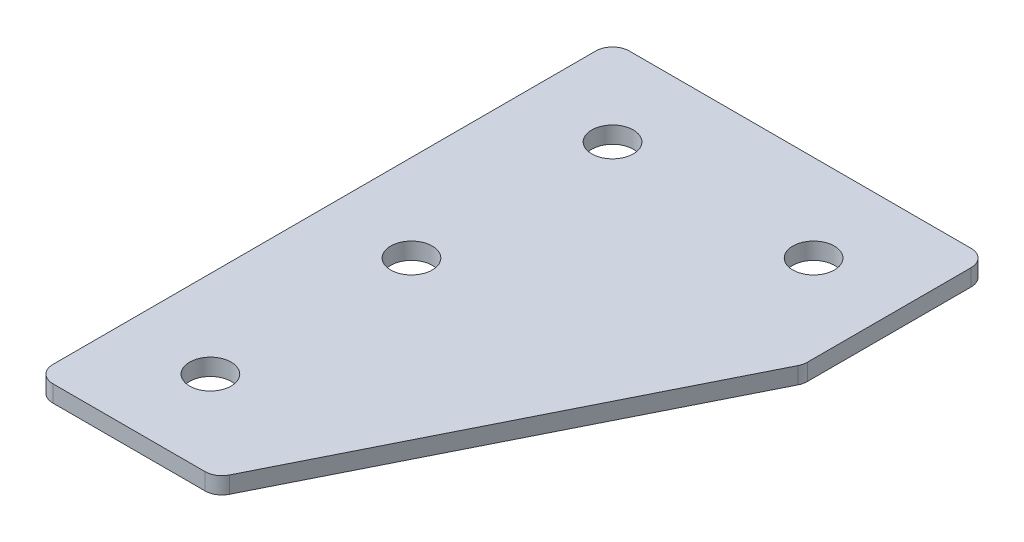
ISO-10303-21;
HEADER;
FILE_DESCRIPTION(('STEP AP214'),'2;1');
FILE_NAME('part.step','',(''),(''),'','','');
FILE_SCHEMA(('AUTOMOTIVE_DESIGN { 1 0 10303 214 1 1 1 1 }'));
ENDSEC;
DATA;
#1=APPLICATION_CONTEXT('core data for automotive mechanical design processes');
#2=APPLICATION_PROTOCOL_DEFINITION('international standard','automotive_design',2000,#1);
#3=PRODUCT_CONTEXT('',#1,'mechanical');
#4=PRODUCT('Part','Part','',(#3));
#5=PRODUCT_RELATED_PRODUCT_CATEGORY('part','',(#4));
#6=PRODUCT_DEFINITION_FORMATION('','',#4);
#7=PRODUCT_DEFINITION_CONTEXT('part definition',#1,'design');
#8=PRODUCT_DEFINITION('design','',#6,#7);
#9=PRODUCT_DEFINITION_SHAPE('','',#8);
#10=(LENGTH_UNIT() NAMED_UNIT(*) SI_UNIT(.MILLI.,.METRE.));
#11=(NAMED_UNIT(*) PLANE_ANGLE_UNIT() SI_UNIT($,.RADIAN.));
#12=(NAMED_UNIT(*) SI_UNIT($,.STERADIAN.) SOLID_ANGLE_UNIT());
#13=UNCERTAINTY_MEASURE_WITH_UNIT(LENGTH_MEASURE(1.E-05),#10,'distance_accuracy_value','');
#14=(GEOMETRIC_REPRESENTATION_CONTEXT(3) GLOBAL_UNCERTAINTY_ASSIGNED_CONTEXT((#13)) GLOBAL_UNIT_ASSIGNED_CONTEXT((#10,
#11,#12)) REPRESENTATION_CONTEXT('',''));
#15=CARTESIAN_POINT('',(0.,0.,0.));
#16=DIRECTION('',(0.,0.,1.));
#17=DIRECTION('',(1.,0.,0.));
#18=AXIS2_PLACEMENT_3D('',#15,#16,#17);
#19=CARTESIAN_POINT('',(-15.9120032783015,0.374792376219375,-30.7125250450599));
#20=DIRECTION('',(0.,-1.,0.));
#21=DIRECTION('',(0.,0.,-1.));
#22=AXIS2_PLACEMENT_3D('',#19,#20,#21);
#23=PLANE('',#22);
#24=CARTESIAN_POINT('',(-15.9120032783016,0.374792376219375,29.2874749549401));
#25=DIRECTION('',(0.,1.,0.));
#26=DIRECTION('',(0.,0.,1.));
#27=AXIS2_PLACEMENT_3D('',#24,#25,#26);
#28=CIRCLE('',#27,3.1);
#29=CARTESIAN_POINT('',(-15.9120032783016,0.374792376219375,32.3874749549401));
#30=VERTEX_POINT('',#29);
#31=EDGE_CURVE('E245',#30,#30,#28,.T.);
#32=ORIENTED_EDGE('',*,*,#31,.T.);
#33=EDGE_LOOP('',(#32));
#34=FACE_BOUND('',#33,.T.);
#35=CARTESIAN_POINT('',(-15.9120032783016,0.374792376219375,-0.712525045059878));
#36=DIRECTION('',(0.,1.,0.));
#37=DIRECTION('',(0.,0.,1.));
#38=AXIS2_PLACEMENT_3D('',#35,#36,#37);
#39=CIRCLE('',#38,3.1);
#40=CARTESIAN_POINT('',(-15.9120032783016,0.374792376219375,2.38747495494012));
#41=VERTEX_POINT('',#40);
#42=EDGE_CURVE('E253',#41,#41,#39,.T.);
#43=ORIENTED_EDGE('',*,*,#42,.T.);
#44=EDGE_LOOP('',(#43));
#45=FACE_BOUND('',#44,.T.);
#46=CARTESIAN_POINT('',(14.0879967216985,0.374792376219375,-30.7125250450599));
#47=DIRECTION('',(0.,1.,0.));
#48=DIRECTION('',(0.,0.,1.));
#49=AXIS2_PLACEMENT_3D('',#46,#47,#48);
#50=CIRCLE('',#49,3.1);
#51=CARTESIAN_POINT('',(14.0879967216985,0.374792376219375,-27.6125250450599));
#52=VERTEX_POINT('',#51);
#53=EDGE_CURVE('E259',#52,#52,#50,.T.);
#54=ORIENTED_EDGE('',*,*,#53,.T.);
#55=EDGE_LOOP('',(#54));
#56=FACE_BOUND('',#55,.T.);
#57=CARTESIAN_POINT('',(-15.9120032783015,0.374792376219375,-30.7125250450599));
#58=DIRECTION('',(0.,1.,0.));
#59=DIRECTION('',(0.,0.,1.));
#60=AXIS2_PLACEMENT_3D('',#57,#58,#59);
#61=CIRCLE('',#60,3.1);
#62=CARTESIAN_POINT('',(-15.9120032783015,0.374792376219375,-27.6125250450599));
#63=VERTEX_POINT('',#62);
#64=EDGE_CURVE('E176',#63,#63,#61,.T.);
#65=ORIENTED_EDGE('',*,*,#64,.T.);
#66=EDGE_LOOP('',(#65));
#67=FACE_BOUND('',#66,.T.);
#68=DIRECTION('',(1.,0.,0.));
#69=VECTOR('',#68,1.);
#70=CARTESIAN_POINT('',(-28.9120032783017,0.374792376219375,42.2874749549401));
#71=LINE('',#70,#69);
#72=CARTESIAN_POINT('',(-26.4120032783017,0.374792376219375,42.2874749549401));
#73=VERTEX_POINT('',#72);
#74=CARTESIAN_POINT('',(-3.69315622767597,0.374792376219375,42.2874749549401));
#75=VERTEX_POINT('',#74);
#76=EDGE_CURVE('E165',#73,#75,#71,.T.);
#77=ORIENTED_EDGE('',*,*,#76,.F.);
#78=CARTESIAN_POINT('',(-26.4120032783017,0.374792376219375,39.7874749549401));
#79=DIRECTION('',(0.,-1.,0.));
#80=DIRECTION('',(0.,0.,-1.));
#81=AXIS2_PLACEMENT_3D('',#78,#79,#80);
#82=CIRCLE('',#81,2.5);
#83=CARTESIAN_POINT('',(-28.9120032783017,0.374792376219375,39.7874749549401));
#84=VERTEX_POINT('',#83);
#85=EDGE_CURVE('E146',#73,#84,#82,.T.);
#86=ORIENTED_EDGE('',*,*,#85,.T.);
#87=DIRECTION('',(0.,0.,1.));
#88=VECTOR('',#87,1.);
#89=CARTESIAN_POINT('',(-28.9120032783017,0.374792376219375,-43.7125250450599));
#90=LINE('',#89,#88);
#91=CARTESIAN_POINT('',(-28.9120032783017,0.374792376219375,-41.2125250450599));
#92=VERTEX_POINT('',#91);
#93=EDGE_CURVE('E163',#92,#84,#90,.T.);
#94=ORIENTED_EDGE('',*,*,#93,.F.);
#95=CARTESIAN_POINT('',(-26.4120032783017,0.374792376219375,-41.2125250450599));
#96=DIRECTION('',(0.,-1.,0.));
#97=DIRECTION('',(0.,0.,-1.));
#98=AXIS2_PLACEMENT_3D('',#95,#96,#97);
#99=CIRCLE('',#98,2.5);
#100=CARTESIAN_POINT('',(-26.4120032783016,0.374792376219375,-43.7125250450599));
#101=VERTEX_POINT('',#100);
#102=EDGE_CURVE('E117',#92,#101,#99,.T.);
#103=ORIENTED_EDGE('',*,*,#102,.T.);
#104=DIRECTION('',(-1.,0.,0.));
#105=VECTOR('',#104,1.);
#106=CARTESIAN_POINT('',(27.0879967216983,0.374792376219375,-43.7125250450599));
#107=LINE('',#106,#105);
#108=CARTESIAN_POINT('',(24.5879967216983,0.374792376219375,-43.7125250450599));
#109=VERTEX_POINT('',#108);
#110=EDGE_CURVE('E161',#109,#101,#107,.T.);
#111=ORIENTED_EDGE('',*,*,#110,.F.);
#112=CARTESIAN_POINT('',(24.5879967216983,0.374792376219375,-41.2125250450599));
#113=DIRECTION('',(0.,-1.,0.));
#114=DIRECTION('',(0.,0.,-1.));
#115=AXIS2_PLACEMENT_3D('',#112,#113,#114);
#116=CIRCLE('',#115,2.5);
#117=CARTESIAN_POINT('',(27.0879967216983,0.374792376219375,-41.2125250450599));
#118=VERTEX_POINT('',#117);
#119=EDGE_CURVE('E141',#109,#118,#116,.T.);
#120=ORIENTED_EDGE('',*,*,#119,.T.);
#121=DIRECTION('',(0.,0.,-1.));
#122=VECTOR('',#121,1.);
#123=CARTESIAN_POINT('',(27.0879967216983,0.374792376219375,-16.1846610000594));
#124=LINE('',#123,#122);
#125=CARTESIAN_POINT('',(27.0879967216983,0.374792376219375,-16.7748309438089));
#126=VERTEX_POINT('',#125);
#127=EDGE_CURVE('E118',#126,#118,#124,.T.);
#128=ORIENTED_EDGE('',*,*,#127,.F.);
#129=CARTESIAN_POINT('',(24.5879967216983,0.374792376219375,-16.7748309438089));
#130=DIRECTION('',(0.,-1.,0.));
#131=DIRECTION('',(0.,0.,-1.));
#132=AXIS2_PLACEMENT_3D('',#129,#130,#131);
#133=CIRCLE('',#132,2.5);
#134=CARTESIAN_POINT('',(26.8240646991981,0.374792376219375,-15.656796955059));
#135=VERTEX_POINT('',#134);
#136=EDGE_CURVE('E31',#126,#135,#133,.T.);
#137=ORIENTED_EDGE('',*,*,#136,.T.);
#138=DIRECTION('',(0.447213595499956,0.,-0.894427190999917));
#139=VECTOR('',#138,1.);
#140=CARTESIAN_POINT('',(-2.14807125580123,0.374792376219375,42.2874749549401));
#141=LINE('',#140,#139);
#142=CARTESIAN_POINT('',(-1.45708825017618,0.374792376219375,40.90550894369));
#143=VERTEX_POINT('',#142);
#144=EDGE_CURVE('E122',#143,#135,#141,.T.);
#145=ORIENTED_EDGE('',*,*,#144,.F.);
#146=CARTESIAN_POINT('',(-3.69315622767597,0.374792376219375,39.7874749549401));
#147=DIRECTION('',(0.,-1.,0.));
#148=DIRECTION('',(0.,0.,-1.));
#149=AXIS2_PLACEMENT_3D('',#146,#147,#148);
#150=CIRCLE('',#149,2.5);
#151=EDGE_CURVE('E144',#143,#75,#150,.T.);
#152=ORIENTED_EDGE('',*,*,#151,.T.);
#153=EDGE_LOOP('',(#77,#86,#94,#103,#111,#120,#128,#137,#145,#152));
#154=FACE_BOUND('',#153,.T.);
#155=ADVANCED_FACE('F16',(#34,#45,#56,#67,#154),#23,.T.);
#156=CARTESIAN_POINT('',(27.0879967216983,0.374792376219375,-43.7125250450599));
#157=DIRECTION('',(0.,0.,-1.));
#158=DIRECTION('',(-1.,0.,0.));
#159=AXIS2_PLACEMENT_3D('',#156,#157,#158);
#160=PLANE('',#159);
#161=DIRECTION('',(-1.,0.,0.));
#162=VECTOR('',#161,1.);
#163=CARTESIAN_POINT('',(27.0879967216983,2.87479237621938,-43.7125250450599));
#164=LINE('',#163,#162);
#165=CARTESIAN_POINT('',(24.5879967216983,2.87479237621938,-43.7125250450599));
#166=VERTEX_POINT('',#165);
#167=CARTESIAN_POINT('',(-26.4120032783016,2.87479237621938,-43.7125250450599));
#168=VERTEX_POINT('',#167);
#169=EDGE_CURVE('E99',#166,#168,#164,.T.);
#170=ORIENTED_EDGE('',*,*,#169,.F.);
#171=DIRECTION('',(0.,1.,0.));
#172=VECTOR('',#171,1.);
#173=CARTESIAN_POINT('',(24.5879967216983,0.374792376219375,-43.7125250450599));
#174=LINE('',#173,#172);
#175=EDGE_CURVE('E10',#166,#109,#174,.F.);
#176=ORIENTED_EDGE('',*,*,#175,.T.);
#177=ORIENTED_EDGE('',*,*,#110,.T.);
#178=DIRECTION('',(0.,1.,0.));
#179=VECTOR('',#178,1.);
#180=CARTESIAN_POINT('',(-26.4120032783017,0.374792376219375,-43.7125250450599));
#181=LINE('',#180,#179);
#182=EDGE_CURVE('E24',#101,#168,#181,.T.);
#183=ORIENTED_EDGE('',*,*,#182,.T.);
#184=EDGE_LOOP('',(#170,#176,#177,#183));
#185=FACE_BOUND('',#184,.T.);
#186=ADVANCED_FACE('F158',(#185),#160,.T.);
#187=CARTESIAN_POINT('',(27.0879967216983,0.374792376219375,-16.1846610000594));
#188=DIRECTION('',(1.,0.,0.));
#189=DIRECTION('',(0.,0.,-1.));
#190=AXIS2_PLACEMENT_3D('',#187,#188,#189);
#191=PLANE('',#190);
#192=DIRECTION('',(0.,0.,-1.));
#193=VECTOR('',#192,1.);
#194=CARTESIAN_POINT('',(27.0879967216983,2.87479237621938,-16.1846610000594));
#195=LINE('',#194,#193);
#196=CARTESIAN_POINT('',(27.0879967216983,2.87479237621938,-16.7748309438089));
#197=VERTEX_POINT('',#196);
#198=CARTESIAN_POINT('',(27.0879967216983,2.87479237621938,-41.2125250450599));
#199=VERTEX_POINT('',#198);
#200=EDGE_CURVE('E125',#197,#199,#195,.T.);
#201=ORIENTED_EDGE('',*,*,#200,.F.);
#202=DIRECTION('',(0.,1.,0.));
#203=VECTOR('',#202,1.);
#204=CARTESIAN_POINT('',(27.0879967216983,0.374792376219375,-16.7748309438089));
#205=LINE('',#204,#203);
#206=EDGE_CURVE('E155',#197,#126,#205,.F.);
#207=ORIENTED_EDGE('',*,*,#206,.T.);
#208=ORIENTED_EDGE('',*,*,#127,.T.);
#209=DIRECTION('',(0.,1.,0.));
#210=VECTOR('',#209,1.);
#211=CARTESIAN_POINT('',(27.0879967216983,0.374792376219375,-41.2125250450599));
#212=LINE('',#211,#210);
#213=EDGE_CURVE('E152',#118,#199,#212,.T.);
#214=ORIENTED_EDGE('',*,*,#213,.T.);
#215=EDGE_LOOP('',(#201,#207,#208,#214));
#216=FACE_BOUND('',#215,.T.);
#217=ADVANCED_FACE('F212',(#216),#191,.T.);
#218=CARTESIAN_POINT('',(-2.14807125580123,0.374792376219375,42.2874749549401));
#219=DIRECTION('',(0.894427190999917,0.,0.447213595499956));
#220=DIRECTION('',(0.447213595499956,0.,-0.894427190999917));
#221=AXIS2_PLACEMENT_3D('',#218,#219,#220);
#222=PLANE('',#221);
#223=DIRECTION('',(0.447213595499956,0.,-0.894427190999917));
#224=VECTOR('',#223,1.);
#225=CARTESIAN_POINT('',(-2.14807125580123,2.87479237621938,42.2874749549401));
#226=LINE('',#225,#224);
#227=CARTESIAN_POINT('',(-1.45708825017618,2.87479237621938,40.90550894369));
#228=VERTEX_POINT('',#227);
#229=CARTESIAN_POINT('',(26.8240646991981,2.87479237621938,-15.656796955059));
#230=VERTEX_POINT('',#229);
#231=EDGE_CURVE('E168',#228,#230,#226,.T.);
#232=ORIENTED_EDGE('',*,*,#231,.F.);
#233=DIRECTION('',(0.,1.,0.));
#234=VECTOR('',#233,1.);
#235=CARTESIAN_POINT('',(-1.45708825017618,0.374792376219375,40.90550894369));
#236=LINE('',#235,#234);
#237=EDGE_CURVE('E38',#228,#143,#236,.F.);
#238=ORIENTED_EDGE('',*,*,#237,.T.);
#239=ORIENTED_EDGE('',*,*,#144,.T.);
#240=DIRECTION('',(0.,1.,0.));
#241=VECTOR('',#240,1.);
#242=CARTESIAN_POINT('',(26.8240646991981,0.374792376219375,-15.656796955059));
#243=LINE('',#242,#241);
#244=EDGE_CURVE('E148',#135,#230,#243,.T.);
#245=ORIENTED_EDGE('',*,*,#244,.T.);
#246=EDGE_LOOP('',(#232,#238,#239,#245));
#247=FACE_BOUND('',#246,.T.);
#248=ADVANCED_FACE('F181',(#247),#222,.T.);
#249=CARTESIAN_POINT('',(-28.9120032783017,0.374792376219375,42.2874749549401));
#250=DIRECTION('',(0.,0.,1.));
#251=DIRECTION('',(1.,0.,0.));
#252=AXIS2_PLACEMENT_3D('',#249,#250,#251);
#253=PLANE('',#252);
#254=DIRECTION('',(1.,0.,0.));
#255=VECTOR('',#254,1.);
#256=CARTESIAN_POINT('',(-28.9120032783017,2.87479237621938,42.2874749549401));
#257=LINE('',#256,#255);
#258=CARTESIAN_POINT('',(-26.4120032783017,2.87479237621938,42.2874749549401));
#259=VERTEX_POINT('',#258);
#260=CARTESIAN_POINT('',(-3.69315622767597,2.87479237621938,42.2874749549401));
#261=VERTEX_POINT('',#260);
#262=EDGE_CURVE('E114',#259,#261,#257,.T.);
#263=ORIENTED_EDGE('',*,*,#262,.F.);
#264=DIRECTION('',(0.,1.,0.));
#265=VECTOR('',#264,1.);
#266=CARTESIAN_POINT('',(-26.4120032783017,0.374792376219375,42.2874749549401));
#267=LINE('',#266,#265);
#268=EDGE_CURVE('E138',#259,#73,#267,.F.);
#269=ORIENTED_EDGE('',*,*,#268,.T.);
#270=ORIENTED_EDGE('',*,*,#76,.T.);
#271=DIRECTION('',(0.,1.,0.));
#272=VECTOR('',#271,1.);
#273=CARTESIAN_POINT('',(-3.69315622767597,0.374792376219375,42.2874749549401));
#274=LINE('',#273,#272);
#275=EDGE_CURVE('E135',#75,#261,#274,.T.);
#276=ORIENTED_EDGE('',*,*,#275,.T.);
#277=EDGE_LOOP('',(#263,#269,#270,#276));
#278=FACE_BOUND('',#277,.T.);
#279=ADVANCED_FACE('F191',(#278),#253,.T.);
#280=CARTESIAN_POINT('',(-28.9120032783017,0.374792376219375,-43.7125250450599));
#281=DIRECTION('',(-1.,0.,0.));
#282=DIRECTION('',(0.,0.,1.));
#283=AXIS2_PLACEMENT_3D('',#280,#281,#282);
#284=PLANE('',#283);
#285=ORIENTED_EDGE('',*,*,#93,.T.);
#286=DIRECTION('',(0.,1.,0.));
#287=VECTOR('',#286,1.);
#288=CARTESIAN_POINT('',(-28.9120032783017,0.374792376219375,39.7874749549401));
#289=LINE('',#288,#287);
#290=CARTESIAN_POINT('',(-28.9120032783017,2.87479237621938,39.7874749549401));
#291=VERTEX_POINT('',#290);
#292=EDGE_CURVE('E105',#84,#291,#289,.T.);
#293=ORIENTED_EDGE('',*,*,#292,.T.);
#294=DIRECTION('',(0.,0.,1.));
#295=VECTOR('',#294,1.);
#296=CARTESIAN_POINT('',(-28.9120032783017,2.87479237621938,-43.7125250450599));
#297=LINE('',#296,#295);
#298=CARTESIAN_POINT('',(-28.9120032783017,2.87479237621938,-41.2125250450599));
#299=VERTEX_POINT('',#298);
#300=EDGE_CURVE('E97',#299,#291,#297,.T.);
#301=ORIENTED_EDGE('',*,*,#300,.F.);
#302=DIRECTION('',(0.,1.,0.));
#303=VECTOR('',#302,1.);
#304=CARTESIAN_POINT('',(-28.9120032783017,0.374792376219375,-41.2125250450599));
#305=LINE('',#304,#303);
#306=EDGE_CURVE('E111',#299,#92,#305,.F.);
#307=ORIENTED_EDGE('',*,*,#306,.T.);
#308=EDGE_LOOP('',(#285,#293,#301,#307));
#309=FACE_BOUND('',#308,.T.);
#310=ADVANCED_FACE('F110',(#309),#284,.T.);
#311=CARTESIAN_POINT('',(-15.9120032783015,2.87479237621938,-30.7125250450599));
#312=DIRECTION('',(0.,-1.,0.));
#313=DIRECTION('',(0.,0.,-1.));
#314=AXIS2_PLACEMENT_3D('',#311,#312,#313);
#315=PLANE('',#314);
#316=CARTESIAN_POINT('',(-15.9120032783016,2.87479237621938,29.2874749549401));
#317=DIRECTION('',(0.,1.,0.));
#318=DIRECTION('',(0.,0.,1.));
#319=AXIS2_PLACEMENT_3D('',#316,#317,#318);
#320=CIRCLE('',#319,3.1);
#321=CARTESIAN_POINT('',(-15.9120032783016,2.87479237621938,32.3874749549401));
#322=VERTEX_POINT('',#321);
#323=EDGE_CURVE('E248',#322,#322,#320,.T.);
#324=ORIENTED_EDGE('',*,*,#323,.F.);
#325=EDGE_LOOP('',(#324));
#326=FACE_BOUND('',#325,.T.);
#327=CARTESIAN_POINT('',(-15.9120032783016,2.87479237621938,-0.712525045059878));
#328=DIRECTION('',(0.,1.,0.));
#329=DIRECTION('',(0.,0.,1.));
#330=AXIS2_PLACEMENT_3D('',#327,#328,#329);
#331=CIRCLE('',#330,3.1);
#332=CARTESIAN_POINT('',(-15.9120032783016,2.87479237621938,2.38747495494012));
#333=VERTEX_POINT('',#332);
#334=EDGE_CURVE('E250',#333,#333,#331,.T.);
#335=ORIENTED_EDGE('',*,*,#334,.F.);
#336=EDGE_LOOP('',(#335));
#337=FACE_BOUND('',#336,.T.);
#338=CARTESIAN_POINT('',(14.0879967216985,2.87479237621938,-30.7125250450599));
#339=DIRECTION('',(0.,1.,0.));
#340=DIRECTION('',(0.,0.,1.));
#341=AXIS2_PLACEMENT_3D('',#338,#339,#340);
#342=CIRCLE('',#341,3.1);
#343=CARTESIAN_POINT('',(14.0879967216985,2.87479237621938,-27.6125250450599));
#344=VERTEX_POINT('',#343);
#345=EDGE_CURVE('E256',#344,#344,#342,.T.);
#346=ORIENTED_EDGE('',*,*,#345,.F.);
#347=EDGE_LOOP('',(#346));
#348=FACE_BOUND('',#347,.T.);
#349=CARTESIAN_POINT('',(-15.9120032783015,2.87479237621938,-30.7125250450599));
#350=DIRECTION('',(0.,1.,0.));
#351=DIRECTION('',(0.,0.,1.));
#352=AXIS2_PLACEMENT_3D('',#349,#350,#351);
#353=CIRCLE('',#352,3.1);
#354=CARTESIAN_POINT('',(-15.9120032783015,2.87479237621938,-27.6125250450599));
#355=VERTEX_POINT('',#354);
#356=EDGE_CURVE('E170',#355,#355,#353,.T.);
#357=ORIENTED_EDGE('',*,*,#356,.F.);
#358=EDGE_LOOP('',(#357));
#359=FACE_BOUND('',#358,.T.);
#360=ORIENTED_EDGE('',*,*,#300,.T.);
#361=CARTESIAN_POINT('',(-26.4120032783017,2.87479237621938,39.7874749549401));
#362=DIRECTION('',(0.,-1.,0.));
#363=DIRECTION('',(0.,0.,-1.));
#364=AXIS2_PLACEMENT_3D('',#361,#362,#363);
#365=CIRCLE('',#364,2.5);
#366=EDGE_CURVE('E133',#291,#259,#365,.F.);
#367=ORIENTED_EDGE('',*,*,#366,.T.);
#368=ORIENTED_EDGE('',*,*,#262,.T.);
#369=CARTESIAN_POINT('',(-3.69315622767597,2.87479237621938,39.7874749549401));
#370=DIRECTION('',(0.,-1.,0.));
#371=DIRECTION('',(0.,0.,-1.));
#372=AXIS2_PLACEMENT_3D('',#369,#370,#371);
#373=CIRCLE('',#372,2.5);
#374=EDGE_CURVE('E131',#261,#228,#373,.F.);
#375=ORIENTED_EDGE('',*,*,#374,.T.);
#376=ORIENTED_EDGE('',*,*,#231,.T.);
#377=CARTESIAN_POINT('',(24.5879967216983,2.87479237621938,-16.7748309438089));
#378=DIRECTION('',(0.,-1.,0.));
#379=DIRECTION('',(0.,0.,-1.));
#380=AXIS2_PLACEMENT_3D('',#377,#378,#379);
#381=CIRCLE('',#380,2.5);
#382=EDGE_CURVE('E129',#230,#197,#381,.F.);
#383=ORIENTED_EDGE('',*,*,#382,.T.);
#384=ORIENTED_EDGE('',*,*,#200,.T.);
#385=CARTESIAN_POINT('',(24.5879967216983,2.87479237621938,-41.2125250450599));
#386=DIRECTION('',(0.,-1.,0.));
#387=DIRECTION('',(0.,0.,-1.));
#388=AXIS2_PLACEMENT_3D('',#385,#386,#387);
#389=CIRCLE('',#388,2.5);
#390=EDGE_CURVE('E104',#199,#166,#389,.F.);
#391=ORIENTED_EDGE('',*,*,#390,.T.);
#392=ORIENTED_EDGE('',*,*,#169,.T.);
#393=CARTESIAN_POINT('',(-26.4120032783017,2.87479237621938,-41.2125250450599));
#394=DIRECTION('',(0.,-1.,0.));
#395=DIRECTION('',(0.,0.,-1.));
#396=AXIS2_PLACEMENT_3D('',#393,#394,#395);
#397=CIRCLE('',#396,2.5);
#398=EDGE_CURVE('E94',#168,#299,#397,.F.);
#399=ORIENTED_EDGE('',*,*,#398,.T.);
#400=EDGE_LOOP('',(#360,#367,#368,#375,#376,#383,#384,#391,#392,#399));
#401=FACE_BOUND('',#400,.T.);
#402=ADVANCED_FACE('F96',(#326,#337,#348,#359,#401),#315,.F.);
#403=CARTESIAN_POINT('',(-26.4120032783017,0.374792376219375,39.7874749549401));
#404=DIRECTION('',(0.,1.,0.));
#405=DIRECTION('',(0.,0.,1.));
#406=AXIS2_PLACEMENT_3D('',#403,#404,#405);
#407=CYLINDRICAL_SURFACE('',#406,2.5);
#408=ORIENTED_EDGE('',*,*,#85,.F.);
#409=ORIENTED_EDGE('',*,*,#268,.F.);
#410=ORIENTED_EDGE('',*,*,#366,.F.);
#411=ORIENTED_EDGE('',*,*,#292,.F.);
#412=EDGE_LOOP('',(#408,#409,#410,#411));
#413=FACE_BOUND('',#412,.T.);
#414=ADVANCED_FACE('F194',(#413),#407,.T.);
#415=CARTESIAN_POINT('',(-3.69315622767597,0.374792376219375,39.7874749549401));
#416=DIRECTION('',(0.,1.,0.));
#417=DIRECTION('',(0.,0.,1.));
#418=AXIS2_PLACEMENT_3D('',#415,#416,#417);
#419=CYLINDRICAL_SURFACE('',#418,2.5);
#420=ORIENTED_EDGE('',*,*,#151,.F.);
#421=ORIENTED_EDGE('',*,*,#237,.F.);
#422=ORIENTED_EDGE('',*,*,#374,.F.);
#423=ORIENTED_EDGE('',*,*,#275,.F.);
#424=EDGE_LOOP('',(#420,#421,#422,#423));
#425=FACE_BOUND('',#424,.T.);
#426=ADVANCED_FACE('F185',(#425),#419,.T.);
#427=CARTESIAN_POINT('',(24.5879967216983,0.374792376219375,-16.7748309438089));
#428=DIRECTION('',(0.,1.,0.));
#429=DIRECTION('',(0.,0.,1.));
#430=AXIS2_PLACEMENT_3D('',#427,#428,#429);
#431=CYLINDRICAL_SURFACE('',#430,2.5);
#432=ORIENTED_EDGE('',*,*,#136,.F.);
#433=ORIENTED_EDGE('',*,*,#206,.F.);
#434=ORIENTED_EDGE('',*,*,#382,.F.);
#435=ORIENTED_EDGE('',*,*,#244,.F.);
#436=EDGE_LOOP('',(#432,#433,#434,#435));
#437=FACE_BOUND('',#436,.T.);
#438=ADVANCED_FACE('F202',(#437),#431,.T.);
#439=CARTESIAN_POINT('',(24.5879967216983,0.374792376219375,-41.2125250450599));
#440=DIRECTION('',(0.,1.,0.));
#441=DIRECTION('',(0.,0.,1.));
#442=AXIS2_PLACEMENT_3D('',#439,#440,#441);
#443=CYLINDRICAL_SURFACE('',#442,2.5);
#444=ORIENTED_EDGE('',*,*,#119,.F.);
#445=ORIENTED_EDGE('',*,*,#175,.F.);
#446=ORIENTED_EDGE('',*,*,#390,.F.);
#447=ORIENTED_EDGE('',*,*,#213,.F.);
#448=EDGE_LOOP('',(#444,#445,#446,#447));
#449=FACE_BOUND('',#448,.T.);
#450=ADVANCED_FACE('F299',(#449),#443,.T.);
#451=CARTESIAN_POINT('',(-26.4120032783017,0.374792376219375,-41.2125250450599));
#452=DIRECTION('',(0.,1.,0.));
#453=DIRECTION('',(0.,0.,1.));
#454=AXIS2_PLACEMENT_3D('',#451,#452,#453);
#455=CYLINDRICAL_SURFACE('',#454,2.5);
#456=ORIENTED_EDGE('',*,*,#102,.F.);
#457=ORIENTED_EDGE('',*,*,#306,.F.);
#458=ORIENTED_EDGE('',*,*,#398,.F.);
#459=ORIENTED_EDGE('',*,*,#182,.F.);
#460=EDGE_LOOP('',(#456,#457,#458,#459));
#461=FACE_BOUND('',#460,.T.);
#462=ADVANCED_FACE('F18',(#461),#455,.T.);
#463=CARTESIAN_POINT('',(-15.9120032783015,0.374792376219375,-30.7125250450599));
#464=DIRECTION('',(0.,1.,0.));
#465=DIRECTION('',(0.,0.,1.));
#466=AXIS2_PLACEMENT_3D('',#463,#464,#465);
#467=CYLINDRICAL_SURFACE('',#466,3.1);
#468=ORIENTED_EDGE('',*,*,#64,.F.);
#469=EDGE_LOOP('',(#468));
#470=FACE_BOUND('',#469,.T.);
#471=ORIENTED_EDGE('',*,*,#356,.T.);
#472=EDGE_LOOP('',(#471));
#473=FACE_BOUND('',#472,.T.);
#474=ADVANCED_FACE('F226',(#470,#473),#467,.F.);
#475=CARTESIAN_POINT('',(14.0879967216985,0.374792376219375,-30.7125250450599));
#476=DIRECTION('',(0.,1.,0.));
#477=DIRECTION('',(0.,0.,1.));
#478=AXIS2_PLACEMENT_3D('',#475,#476,#477);
#479=CYLINDRICAL_SURFACE('',#478,3.1);
#480=ORIENTED_EDGE('',*,*,#53,.F.);
#481=EDGE_LOOP('',(#480));
#482=FACE_BOUND('',#481,.T.);
#483=ORIENTED_EDGE('',*,*,#345,.T.);
#484=EDGE_LOOP('',(#483));
#485=FACE_BOUND('',#484,.T.);
#486=ADVANCED_FACE('F229',(#482,#485),#479,.F.);
#487=CARTESIAN_POINT('',(-15.9120032783016,0.374792376219375,-0.712525045059878));
#488=DIRECTION('',(0.,1.,0.));
#489=DIRECTION('',(0.,0.,1.));
#490=AXIS2_PLACEMENT_3D('',#487,#488,#489);
#491=CYLINDRICAL_SURFACE('',#490,3.1);
#492=ORIENTED_EDGE('',*,*,#42,.F.);
#493=EDGE_LOOP('',(#492));
#494=FACE_BOUND('',#493,.T.);
#495=ORIENTED_EDGE('',*,*,#334,.T.);
#496=EDGE_LOOP('',(#495));
#497=FACE_BOUND('',#496,.T.);
#498=ADVANCED_FACE('F233',(#494,#497),#491,.F.);
#499=CARTESIAN_POINT('',(-15.9120032783016,0.374792376219375,29.2874749549401));
#500=DIRECTION('',(0.,1.,0.));
#501=DIRECTION('',(0.,0.,1.));
#502=AXIS2_PLACEMENT_3D('',#499,#500,#501);
#503=CYLINDRICAL_SURFACE('',#502,3.1);
#504=ORIENTED_EDGE('',*,*,#31,.F.);
#505=EDGE_LOOP('',(#504));
#506=FACE_BOUND('',#505,.T.);
#507=ORIENTED_EDGE('',*,*,#323,.T.);
#508=EDGE_LOOP('',(#507));
#509=FACE_BOUND('',#508,.T.);
#510=ADVANCED_FACE('F237',(#506,#509),#503,.F.);
#511=CLOSED_SHELL('',(#155,#186,#217,#248,#279,#310,#402,#414,#426,#438,#450,#462,#474,#486,
#498,#510));
#512=MANIFOLD_SOLID_BREP('B1',#511);
#513=ADVANCED_BREP_SHAPE_REPRESENTATION('',(#18,#512),#14);
#514=SHAPE_DEFINITION_REPRESENTATION(#9,#513);
ENDSEC;
END-ISO-10303-21;
